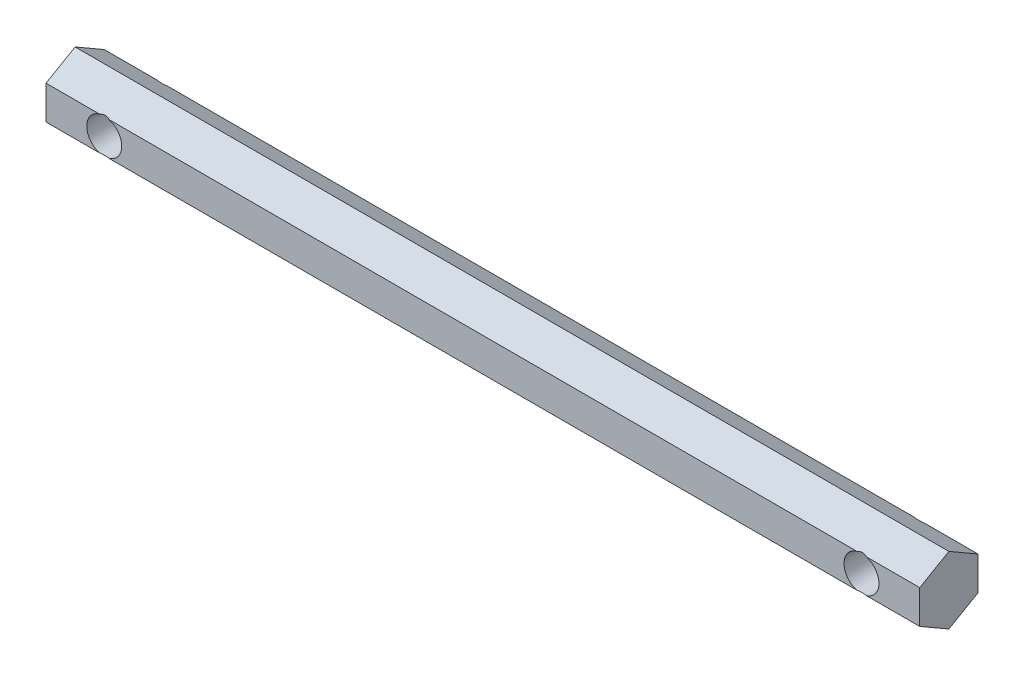
ISO-10303-21;
HEADER;
FILE_DESCRIPTION(('STEP AP214'),'2;1');
FILE_NAME('part.step','',(''),(''),'','','');
FILE_SCHEMA(('AUTOMOTIVE_DESIGN { 1 0 10303 214 1 1 1 1 }'));
ENDSEC;
DATA;
#1=APPLICATION_CONTEXT('core data for automotive mechanical design processes');
#2=APPLICATION_PROTOCOL_DEFINITION('international standard','automotive_design',2000,#1);
#3=PRODUCT_CONTEXT('',#1,'mechanical');
#4=PRODUCT('Part','Part','',(#3));
#5=PRODUCT_RELATED_PRODUCT_CATEGORY('part','',(#4));
#6=PRODUCT_DEFINITION_FORMATION('','',#4);
#7=PRODUCT_DEFINITION_CONTEXT('part definition',#1,'design');
#8=PRODUCT_DEFINITION('design','',#6,#7);
#9=PRODUCT_DEFINITION_SHAPE('','',#8);
#10=(LENGTH_UNIT() NAMED_UNIT(*) SI_UNIT(.MILLI.,.METRE.));
#11=(NAMED_UNIT(*) PLANE_ANGLE_UNIT() SI_UNIT($,.RADIAN.));
#12=(NAMED_UNIT(*) SI_UNIT($,.STERADIAN.) SOLID_ANGLE_UNIT());
#13=UNCERTAINTY_MEASURE_WITH_UNIT(LENGTH_MEASURE(1.E-05),#10,'distance_accuracy_value','');
#14=(GEOMETRIC_REPRESENTATION_CONTEXT(3) GLOBAL_UNCERTAINTY_ASSIGNED_CONTEXT((#13)) GLOBAL_UNIT_ASSIGNED_CONTEXT((#10,
#11,#12)) REPRESENTATION_CONTEXT('',''));
#15=CARTESIAN_POINT('',(0.,0.,0.));
#16=DIRECTION('',(0.,0.,1.));
#17=DIRECTION('',(1.,0.,0.));
#18=AXIS2_PLACEMENT_3D('',#15,#16,#17);
#19=CARTESIAN_POINT('',(75.,2.88675134594811,5.));
#20=DIRECTION('',(0.,0.,-1.));
#21=DIRECTION('',(0.,1.,0.));
#22=AXIS2_PLACEMENT_3D('',#19,#20,#21);
#23=PLANE('',#22);
#24=DIRECTION('',(-1.,0.,0.));
#25=VECTOR('',#24,1.);
#26=CARTESIAN_POINT('',(75.,2.88675134594811,5.));
#27=LINE('',#26,#25);
#28=CARTESIAN_POINT('',(75.,2.88675134594811,5.));
#29=VERTEX_POINT('',#28);
#30=CARTESIAN_POINT('',(65.8164965809278,2.88675134594811,5.));
#31=VERTEX_POINT('',#30);
#32=EDGE_CURVE('E193',#29,#31,#27,.T.);
#33=ORIENTED_EDGE('',*,*,#32,.T.);
#34=CARTESIAN_POINT('',(65.,0.,5.));
#35=DIRECTION('',(0.,0.,1.));
#36=DIRECTION('',(1.,0.,0.));
#37=AXIS2_PLACEMENT_3D('',#34,#35,#36);
#38=CIRCLE('',#37,3.00000000000001);
#39=CARTESIAN_POINT('',(65.8164965809277,-2.88675134594814,5.));
#40=VERTEX_POINT('',#39);
#41=EDGE_CURVE('E311',#40,#31,#38,.T.);
#42=ORIENTED_EDGE('',*,*,#41,.F.);
#43=DIRECTION('',(-1.,0.,0.));
#44=VECTOR('',#43,1.);
#45=CARTESIAN_POINT('',(75.,-2.88675134594815,4.99999999999998));
#46=LINE('',#45,#44);
#47=CARTESIAN_POINT('',(75.,-2.88675134594815,4.99999999999998));
#48=VERTEX_POINT('',#47);
#49=EDGE_CURVE('E187',#48,#40,#46,.T.);
#50=ORIENTED_EDGE('',*,*,#49,.F.);
#51=DIRECTION('',(0.,-1.,0.));
#52=VECTOR('',#51,1.);
#53=CARTESIAN_POINT('',(75.,2.88675134594811,5.));
#54=LINE('',#53,#52);
#55=EDGE_CURVE('E260',#29,#48,#54,.T.);
#56=ORIENTED_EDGE('',*,*,#55,.F.);
#57=EDGE_LOOP('',(#33,#42,#50,#56));
#58=FACE_BOUND('',#57,.T.);
#59=ADVANCED_FACE('F39',(#58),#23,.F.);
#60=CARTESIAN_POINT('',(64.1835034190723,-2.88675134594815,4.99999999999998));
#61=VERTEX_POINT('',#60);
#62=CARTESIAN_POINT('',(-64.1835034190722,-2.88675134594814,5.));
#63=VERTEX_POINT('',#62);
#64=EDGE_CURVE('E192',#61,#63,#46,.T.);
#65=ORIENTED_EDGE('',*,*,#64,.F.);
#66=CARTESIAN_POINT('',(64.1835034190722,2.88675134594811,5.));
#67=VERTEX_POINT('',#66);
#68=EDGE_CURVE('E63',#67,#61,#38,.T.);
#69=ORIENTED_EDGE('',*,*,#68,.F.);
#70=CARTESIAN_POINT('',(-64.1835034190723,2.88675134594811,5.));
#71=VERTEX_POINT('',#70);
#72=EDGE_CURVE('E198',#67,#71,#27,.T.);
#73=ORIENTED_EDGE('',*,*,#72,.T.);
#74=CARTESIAN_POINT('',(-65.,0.,5.));
#75=DIRECTION('',(0.,0.,1.));
#76=DIRECTION('',(1.,0.,0.));
#77=AXIS2_PLACEMENT_3D('',#74,#75,#76);
#78=CIRCLE('',#77,3.00000000000001);
#79=EDGE_CURVE('E226',#63,#71,#78,.T.);
#80=ORIENTED_EDGE('',*,*,#79,.F.);
#81=EDGE_LOOP('',(#65,#69,#73,#80));
#82=FACE_BOUND('',#81,.T.);
#83=ADVANCED_FACE('F225',(#82),#23,.F.);
#84=CARTESIAN_POINT('',(75.,-2.88675134594808,-5.00000000000002));
#85=DIRECTION('',(0.,0.,1.));
#86=DIRECTION('',(0.,-1.,0.));
#87=AXIS2_PLACEMENT_3D('',#84,#85,#86);
#88=PLANE('',#87);
#89=DIRECTION('',(-1.,0.,0.));
#90=VECTOR('',#89,1.);
#91=CARTESIAN_POINT('',(75.,-2.88675134594808,-5.00000000000002));
#92=LINE('',#91,#90);
#93=CARTESIAN_POINT('',(75.,-2.88675134594808,-5.00000000000002));
#94=VERTEX_POINT('',#93);
#95=CARTESIAN_POINT('',(65.816496580928,-2.88675134594808,-5.00000000000002));
#96=VERTEX_POINT('',#95);
#97=EDGE_CURVE('E178',#94,#96,#92,.T.);
#98=ORIENTED_EDGE('',*,*,#97,.T.);
#99=CARTESIAN_POINT('',(65.,0.,-4.99999999999999));
#100=DIRECTION('',(0.,0.,1.));
#101=DIRECTION('',(0.,-1.,0.));
#102=AXIS2_PLACEMENT_3D('',#99,#100,#101);
#103=CIRCLE('',#102,3.00000000000001);
#104=CARTESIAN_POINT('',(65.8164965809275,2.88675134594818,-5.00000000000002));
#105=VERTEX_POINT('',#104);
#106=EDGE_CURVE('E11',#96,#105,#103,.T.);
#107=ORIENTED_EDGE('',*,*,#106,.T.);
#108=DIRECTION('',(-1.,0.,0.));
#109=VECTOR('',#108,1.);
#110=CARTESIAN_POINT('',(75.,2.88675134594818,-4.99999999999996));
#111=LINE('',#110,#109);
#112=CARTESIAN_POINT('',(75.,2.88675134594818,-4.99999999999996));
#113=VERTEX_POINT('',#112);
#114=EDGE_CURVE('E167',#113,#105,#111,.T.);
#115=ORIENTED_EDGE('',*,*,#114,.F.);
#116=DIRECTION('',(0.,1.,0.));
#117=VECTOR('',#116,1.);
#118=CARTESIAN_POINT('',(75.,-2.88675134594808,-5.00000000000002));
#119=LINE('',#118,#117);
#120=EDGE_CURVE('E173',#94,#113,#119,.T.);
#121=ORIENTED_EDGE('',*,*,#120,.F.);
#122=EDGE_LOOP('',(#98,#107,#115,#121));
#123=FACE_BOUND('',#122,.T.);
#124=ADVANCED_FACE('F299',(#123),#88,.F.);
#125=CARTESIAN_POINT('',(64.1835034190725,2.88675134594818,-5.00000000000002));
#126=VERTEX_POINT('',#125);
#127=CARTESIAN_POINT('',(-64.1835034190725,2.88675134594818,-5.00000000000002));
#128=VERTEX_POINT('',#127);
#129=EDGE_CURVE('E159',#126,#128,#111,.T.);
#130=ORIENTED_EDGE('',*,*,#129,.F.);
#131=CARTESIAN_POINT('',(64.183503419072,-2.88675134594808,-5.00000000000002));
#132=VERTEX_POINT('',#131);
#133=EDGE_CURVE('E43',#126,#132,#103,.T.);
#134=ORIENTED_EDGE('',*,*,#133,.T.);
#135=CARTESIAN_POINT('',(-64.183503419072,-2.88675134594808,-5.00000000000002));
#136=VERTEX_POINT('',#135);
#137=EDGE_CURVE('E161',#132,#136,#92,.T.);
#138=ORIENTED_EDGE('',*,*,#137,.T.);
#139=CARTESIAN_POINT('',(-65.,0.,-4.99999999999999));
#140=DIRECTION('',(0.,0.,1.));
#141=DIRECTION('',(0.,-1.,0.));
#142=AXIS2_PLACEMENT_3D('',#139,#140,#141);
#143=CIRCLE('',#142,3.00000000000001);
#144=EDGE_CURVE('E143',#136,#128,#143,.T.);
#145=ORIENTED_EDGE('',*,*,#144,.T.);
#146=EDGE_LOOP('',(#130,#134,#138,#145));
#147=FACE_BOUND('',#146,.T.);
#148=ADVANCED_FACE('F157',(#147),#88,.F.);
#149=CARTESIAN_POINT('',(75.,2.88675134594818,-4.99999999999996));
#150=DIRECTION('',(0.,-0.866025403784442,0.499999999999995));
#151=DIRECTION('',(0.,-0.499999999999995,-0.866025403784442));
#152=AXIS2_PLACEMENT_3D('',#149,#150,#151);
#153=PLANE('',#152);
#154=ORIENTED_EDGE('',*,*,#114,.T.);
#155=CARTESIAN_POINT('',(65.,0.,-10.0000000000001));
#156=DIRECTION('',(0.,-0.866025403784442,0.499999999999995));
#157=DIRECTION('',(0.,0.499999999999995,0.866025403784442));
#158=AXIS2_PLACEMENT_3D('',#155,#156,#157);
#159=ELLIPSE('',#158,6.00000000000008,3.00000000000001);
#160=EDGE_CURVE('E165',#105,#126,#159,.T.);
#161=ORIENTED_EDGE('',*,*,#160,.T.);
#162=ORIENTED_EDGE('',*,*,#129,.T.);
#163=CARTESIAN_POINT('',(-65.,0.,-10.0000000000002));
#164=DIRECTION('',(0.,-0.866025403784442,0.499999999999995));
#165=DIRECTION('',(0.,0.499999999999995,0.866025403784442));
#166=AXIS2_PLACEMENT_3D('',#163,#164,#165);
#167=ELLIPSE('',#166,6.00000000000008,3.00000000000001);
#168=CARTESIAN_POINT('',(-65.8164965809275,2.88675134594818,-5.00000000000002));
#169=VERTEX_POINT('',#168);
#170=EDGE_CURVE('E140',#128,#169,#167,.T.);
#171=ORIENTED_EDGE('',*,*,#170,.T.);
#172=CARTESIAN_POINT('',(-75.,2.88675134594818,-4.99999999999996));
#173=VERTEX_POINT('',#172);
#174=EDGE_CURVE('E168',#169,#173,#111,.T.);
#175=ORIENTED_EDGE('',*,*,#174,.T.);
#176=DIRECTION('',(0.,0.499999999999995,0.866025403784441));
#177=VECTOR('',#176,1.);
#178=CARTESIAN_POINT('',(-75.,2.88675134594818,-4.99999999999996));
#179=LINE('',#178,#177);
#180=CARTESIAN_POINT('',(-75.,5.77350269189625,0.));
#181=VERTEX_POINT('',#180);
#182=EDGE_CURVE('E252',#173,#181,#179,.T.);
#183=ORIENTED_EDGE('',*,*,#182,.T.);
#184=DIRECTION('',(-1.,0.,0.));
#185=VECTOR('',#184,1.);
#186=CARTESIAN_POINT('',(75.,5.77350269189625,0.));
#187=LINE('',#186,#185);
#188=CARTESIAN_POINT('',(75.,5.77350269189625,0.));
#189=VERTEX_POINT('',#188);
#190=EDGE_CURVE('E197',#189,#181,#187,.T.);
#191=ORIENTED_EDGE('',*,*,#190,.F.);
#192=DIRECTION('',(0.,0.499999999999995,0.866025403784441));
#193=VECTOR('',#192,1.);
#194=CARTESIAN_POINT('',(75.,2.88675134594818,-4.99999999999996));
#195=LINE('',#194,#193);
#196=EDGE_CURVE('E253',#113,#189,#195,.T.);
#197=ORIENTED_EDGE('',*,*,#196,.F.);
#198=EDGE_LOOP('',(#154,#161,#162,#171,#175,#183,#191,#197));
#199=FACE_BOUND('',#198,.T.);
#200=ADVANCED_FACE('F41',(#199),#153,.F.);
#201=CARTESIAN_POINT('',(75.,5.77350269189625,0.));
#202=DIRECTION('',(0.,-0.866025403784438,-0.500000000000001));
#203=DIRECTION('',(0.,0.500000000000001,-0.866025403784438));
#204=AXIS2_PLACEMENT_3D('',#201,#202,#203);
#205=PLANE('',#204);
#206=ORIENTED_EDGE('',*,*,#72,.F.);
#207=CARTESIAN_POINT('',(65.,0.,9.99999999999997));
#208=DIRECTION('',(0.,-0.866025403784438,-0.500000000000001));
#209=DIRECTION('',(0.,-0.500000000000001,0.866025403784438));
#210=AXIS2_PLACEMENT_3D('',#207,#208,#209);
#211=ELLIPSE('',#210,6.,3.00000000000001);
#212=EDGE_CURVE('E232',#67,#31,#211,.T.);
#213=ORIENTED_EDGE('',*,*,#212,.T.);
#214=ORIENTED_EDGE('',*,*,#32,.F.);
#215=DIRECTION('',(0.,-0.500000000000001,0.866025403784438));
#216=VECTOR('',#215,1.);
#217=CARTESIAN_POINT('',(75.,5.77350269189625,0.));
#218=LINE('',#217,#216);
#219=EDGE_CURVE('E257',#189,#29,#218,.T.);
#220=ORIENTED_EDGE('',*,*,#219,.F.);
#221=ORIENTED_EDGE('',*,*,#190,.T.);
#222=DIRECTION('',(0.,-0.500000000000001,0.866025403784438));
#223=VECTOR('',#222,1.);
#224=CARTESIAN_POINT('',(-75.,5.77350269189625,0.));
#225=LINE('',#224,#223);
#226=CARTESIAN_POINT('',(-75.,2.88675134594811,5.));
#227=VERTEX_POINT('',#226);
#228=EDGE_CURVE('E274',#181,#227,#225,.T.);
#229=ORIENTED_EDGE('',*,*,#228,.T.);
#230=CARTESIAN_POINT('',(-65.8164965809277,2.88675134594811,5.));
#231=VERTEX_POINT('',#230);
#232=EDGE_CURVE('E191',#231,#227,#27,.T.);
#233=ORIENTED_EDGE('',*,*,#232,.F.);
#234=CARTESIAN_POINT('',(-65.,0.,10.));
#235=DIRECTION('',(0.,-0.866025403784438,-0.500000000000001));
#236=DIRECTION('',(0.,-0.500000000000001,0.866025403784438));
#237=AXIS2_PLACEMENT_3D('',#234,#235,#236);
#238=ELLIPSE('',#237,6.,3.00000000000001);
#239=EDGE_CURVE('E152',#231,#71,#238,.T.);
#240=ORIENTED_EDGE('',*,*,#239,.T.);
#241=EDGE_LOOP('',(#206,#213,#214,#220,#221,#229,#233,#240));
#242=FACE_BOUND('',#241,.T.);
#243=ADVANCED_FACE('F230',(#242),#205,.F.);
#244=CARTESIAN_POINT('',(-65.8164965809278,-2.88675134594815,4.99999999999998));
#245=VERTEX_POINT('',#244);
#246=CARTESIAN_POINT('',(-75.,-2.88675134594815,4.99999999999998));
#247=VERTEX_POINT('',#246);
#248=EDGE_CURVE('E186',#245,#247,#46,.T.);
#249=ORIENTED_EDGE('',*,*,#248,.F.);
#250=EDGE_CURVE('E55',#231,#245,#78,.T.);
#251=ORIENTED_EDGE('',*,*,#250,.F.);
#252=ORIENTED_EDGE('',*,*,#232,.T.);
#253=DIRECTION('',(0.,-1.,0.));
#254=VECTOR('',#253,1.);
#255=CARTESIAN_POINT('',(-75.,2.88675134594811,5.));
#256=LINE('',#255,#254);
#257=EDGE_CURVE('E277',#227,#247,#256,.T.);
#258=ORIENTED_EDGE('',*,*,#257,.T.);
#259=EDGE_LOOP('',(#249,#251,#252,#258));
#260=FACE_BOUND('',#259,.T.);
#261=ADVANCED_FACE('F309',(#260),#23,.F.);
#262=CARTESIAN_POINT('',(75.,-2.88675134594815,4.99999999999998));
#263=DIRECTION('',(0.,0.866025403784441,-0.499999999999995));
#264=DIRECTION('',(0.,0.499999999999995,0.866025403784441));
#265=AXIS2_PLACEMENT_3D('',#262,#263,#264);
#266=PLANE('',#265);
#267=ORIENTED_EDGE('',*,*,#49,.T.);
#268=CARTESIAN_POINT('',(65.,0.,10.0000000000001));
#269=DIRECTION('',(0.,0.866025403784441,-0.499999999999995));
#270=DIRECTION('',(0.,0.499999999999995,0.866025403784441));
#271=AXIS2_PLACEMENT_3D('',#268,#269,#270);
#272=ELLIPSE('',#271,6.00000000000007,3.00000000000001);
#273=EDGE_CURVE('E245',#40,#61,#272,.T.);
#274=ORIENTED_EDGE('',*,*,#273,.T.);
#275=ORIENTED_EDGE('',*,*,#64,.T.);
#276=CARTESIAN_POINT('',(-65.,0.,10.));
#277=DIRECTION('',(0.,0.866025403784441,-0.499999999999995));
#278=DIRECTION('',(0.,0.499999999999995,0.866025403784441));
#279=AXIS2_PLACEMENT_3D('',#276,#277,#278);
#280=ELLIPSE('',#279,6.00000000000008,3.00000000000001);
#281=EDGE_CURVE('E236',#63,#245,#280,.T.);
#282=ORIENTED_EDGE('',*,*,#281,.T.);
#283=ORIENTED_EDGE('',*,*,#248,.T.);
#284=DIRECTION('',(0.,-0.499999999999995,-0.866025403784441));
#285=VECTOR('',#284,1.);
#286=CARTESIAN_POINT('',(-75.,-2.88675134594815,4.99999999999998));
#287=LINE('',#286,#285);
#288=CARTESIAN_POINT('',(-75.,-5.77350269189625,0.));
#289=VERTEX_POINT('',#288);
#290=EDGE_CURVE('E281',#247,#289,#287,.T.);
#291=ORIENTED_EDGE('',*,*,#290,.T.);
#292=DIRECTION('',(-1.,0.,0.));
#293=VECTOR('',#292,1.);
#294=CARTESIAN_POINT('',(75.,-5.77350269189625,0.));
#295=LINE('',#294,#293);
#296=CARTESIAN_POINT('',(75.,-5.77350269189625,0.));
#297=VERTEX_POINT('',#296);
#298=EDGE_CURVE('E182',#297,#289,#295,.T.);
#299=ORIENTED_EDGE('',*,*,#298,.F.);
#300=DIRECTION('',(0.,-0.499999999999995,-0.866025403784441));
#301=VECTOR('',#300,1.);
#302=CARTESIAN_POINT('',(75.,-2.88675134594815,4.99999999999998));
#303=LINE('',#302,#301);
#304=EDGE_CURVE('E263',#48,#297,#303,.T.);
#305=ORIENTED_EDGE('',*,*,#304,.F.);
#306=EDGE_LOOP('',(#267,#274,#275,#282,#283,#291,#299,#305));
#307=FACE_BOUND('',#306,.T.);
#308=ADVANCED_FACE('F306',(#307),#266,.F.);
#309=CARTESIAN_POINT('',(75.,-5.77350269189625,0.));
#310=DIRECTION('',(0.,0.866025403784434,0.500000000000007));
#311=DIRECTION('',(0.,-0.500000000000007,0.866025403784435));
#312=AXIS2_PLACEMENT_3D('',#309,#310,#311);
#313=PLANE('',#312);
#314=ORIENTED_EDGE('',*,*,#137,.F.);
#315=CARTESIAN_POINT('',(65.,0.,-9.99999999999982));
#316=DIRECTION('',(0.,0.866025403784434,0.500000000000007));
#317=DIRECTION('',(0.,-0.500000000000007,0.866025403784435));
#318=AXIS2_PLACEMENT_3D('',#315,#316,#317);
#319=ELLIPSE('',#318,5.99999999999993,3.00000000000001);
#320=EDGE_CURVE('E151',#132,#96,#319,.T.);
#321=ORIENTED_EDGE('',*,*,#320,.T.);
#322=ORIENTED_EDGE('',*,*,#97,.F.);
#323=DIRECTION('',(0.,0.500000000000007,-0.866025403784435));
#324=VECTOR('',#323,1.);
#325=CARTESIAN_POINT('',(75.,-5.77350269189625,0.));
#326=LINE('',#325,#324);
#327=EDGE_CURVE('E266',#297,#94,#326,.T.);
#328=ORIENTED_EDGE('',*,*,#327,.F.);
#329=ORIENTED_EDGE('',*,*,#298,.T.);
#330=DIRECTION('',(0.,0.500000000000007,-0.866025403784435));
#331=VECTOR('',#330,1.);
#332=CARTESIAN_POINT('',(-75.,-5.77350269189625,0.));
#333=LINE('',#332,#331);
#334=CARTESIAN_POINT('',(-75.,-2.88675134594808,-5.00000000000002));
#335=VERTEX_POINT('',#334);
#336=EDGE_CURVE('E211',#289,#335,#333,.T.);
#337=ORIENTED_EDGE('',*,*,#336,.T.);
#338=CARTESIAN_POINT('',(-65.816496580928,-2.88675134594808,-5.00000000000002));
#339=VERTEX_POINT('',#338);
#340=EDGE_CURVE('E172',#339,#335,#92,.T.);
#341=ORIENTED_EDGE('',*,*,#340,.F.);
#342=CARTESIAN_POINT('',(-65.,0.,-9.9999999999998));
#343=DIRECTION('',(0.,0.866025403784434,0.500000000000007));
#344=DIRECTION('',(0.,-0.500000000000007,0.866025403784435));
#345=AXIS2_PLACEMENT_3D('',#342,#343,#344);
#346=ELLIPSE('',#345,5.99999999999993,3.00000000000001);
#347=EDGE_CURVE('E209',#339,#136,#346,.T.);
#348=ORIENTED_EDGE('',*,*,#347,.T.);
#349=EDGE_LOOP('',(#314,#321,#322,#328,#329,#337,#341,#348));
#350=FACE_BOUND('',#349,.T.);
#351=ADVANCED_FACE('F208',(#350),#313,.F.);
#352=ORIENTED_EDGE('',*,*,#174,.F.);
#353=EDGE_CURVE('E146',#169,#339,#143,.T.);
#354=ORIENTED_EDGE('',*,*,#353,.T.);
#355=ORIENTED_EDGE('',*,*,#340,.T.);
#356=DIRECTION('',(0.,1.,0.));
#357=VECTOR('',#356,1.);
#358=CARTESIAN_POINT('',(-75.,-2.88675134594808,-5.00000000000002));
#359=LINE('',#358,#357);
#360=EDGE_CURVE('E176',#335,#173,#359,.T.);
#361=ORIENTED_EDGE('',*,*,#360,.T.);
#362=EDGE_LOOP('',(#352,#354,#355,#361));
#363=FACE_BOUND('',#362,.T.);
#364=ADVANCED_FACE('F204',(#363),#88,.F.);
#365=CARTESIAN_POINT('',(75.,0.,0.));
#366=DIRECTION('',(1.,0.,0.));
#367=DIRECTION('',(0.,0.,-1.));
#368=AXIS2_PLACEMENT_3D('',#365,#366,#367);
#369=PLANE('',#368);
#370=ORIENTED_EDGE('',*,*,#196,.T.);
#371=ORIENTED_EDGE('',*,*,#219,.T.);
#372=ORIENTED_EDGE('',*,*,#55,.T.);
#373=ORIENTED_EDGE('',*,*,#304,.T.);
#374=ORIENTED_EDGE('',*,*,#327,.T.);
#375=ORIENTED_EDGE('',*,*,#120,.T.);
#376=EDGE_LOOP('',(#370,#371,#372,#373,#374,#375));
#377=FACE_BOUND('',#376,.T.);
#378=ADVANCED_FACE('F293',(#377),#369,.T.);
#379=CARTESIAN_POINT('',(-75.,0.,0.));
#380=DIRECTION('',(1.,0.,0.));
#381=DIRECTION('',(0.,0.,-1.));
#382=AXIS2_PLACEMENT_3D('',#379,#380,#381);
#383=PLANE('',#382);
#384=ORIENTED_EDGE('',*,*,#182,.F.);
#385=ORIENTED_EDGE('',*,*,#360,.F.);
#386=ORIENTED_EDGE('',*,*,#336,.F.);
#387=ORIENTED_EDGE('',*,*,#290,.F.);
#388=ORIENTED_EDGE('',*,*,#257,.F.);
#389=ORIENTED_EDGE('',*,*,#228,.F.);
#390=EDGE_LOOP('',(#384,#385,#386,#387,#388,#389));
#391=FACE_BOUND('',#390,.T.);
#392=ADVANCED_FACE('F287',(#391),#383,.F.);
#393=CARTESIAN_POINT('',(-65.,0.,-5.00000000000002));
#394=DIRECTION('',(0.,0.,1.));
#395=DIRECTION('',(1.,0.,0.));
#396=AXIS2_PLACEMENT_3D('',#393,#394,#395);
#397=CYLINDRICAL_SURFACE('',#396,3.00000000000001);
#398=ORIENTED_EDGE('',*,*,#250,.T.);
#399=ORIENTED_EDGE('',*,*,#281,.F.);
#400=ORIENTED_EDGE('',*,*,#79,.T.);
#401=ORIENTED_EDGE('',*,*,#239,.F.);
#402=EDGE_LOOP('',(#398,#399,#400,#401));
#403=FACE_BOUND('',#402,.T.);
#404=ORIENTED_EDGE('',*,*,#144,.F.);
#405=ORIENTED_EDGE('',*,*,#347,.F.);
#406=ORIENTED_EDGE('',*,*,#353,.F.);
#407=ORIENTED_EDGE('',*,*,#170,.F.);
#408=EDGE_LOOP('',(#404,#405,#406,#407));
#409=FACE_BOUND('',#408,.T.);
#410=ADVANCED_FACE('F142',(#403,#409),#397,.F.);
#411=CARTESIAN_POINT('',(65.,0.,-5.00000000000002));
#412=DIRECTION('',(0.,0.,1.));
#413=DIRECTION('',(1.,0.,0.));
#414=AXIS2_PLACEMENT_3D('',#411,#412,#413);
#415=CYLINDRICAL_SURFACE('',#414,3.00000000000001);
#416=ORIENTED_EDGE('',*,*,#68,.T.);
#417=ORIENTED_EDGE('',*,*,#273,.F.);
#418=ORIENTED_EDGE('',*,*,#41,.T.);
#419=ORIENTED_EDGE('',*,*,#212,.F.);
#420=EDGE_LOOP('',(#416,#417,#418,#419));
#421=FACE_BOUND('',#420,.T.);
#422=ORIENTED_EDGE('',*,*,#106,.F.);
#423=ORIENTED_EDGE('',*,*,#320,.F.);
#424=ORIENTED_EDGE('',*,*,#133,.F.);
#425=ORIENTED_EDGE('',*,*,#160,.F.);
#426=EDGE_LOOP('',(#422,#423,#424,#425));
#427=FACE_BOUND('',#426,.T.);
#428=ADVANCED_FACE('F301',(#421,#427),#415,.F.);
#429=CLOSED_SHELL('',(#59,#83,#124,#148,#200,#243,#261,#308,#351,#364,#378,#392,#410,#428));
#430=MANIFOLD_SOLID_BREP('B2',#429);
#431=ADVANCED_BREP_SHAPE_REPRESENTATION('',(#18,#430),#14);
#432=SHAPE_DEFINITION_REPRESENTATION(#9,#431);
ENDSEC;
END-ISO-10303-21;
